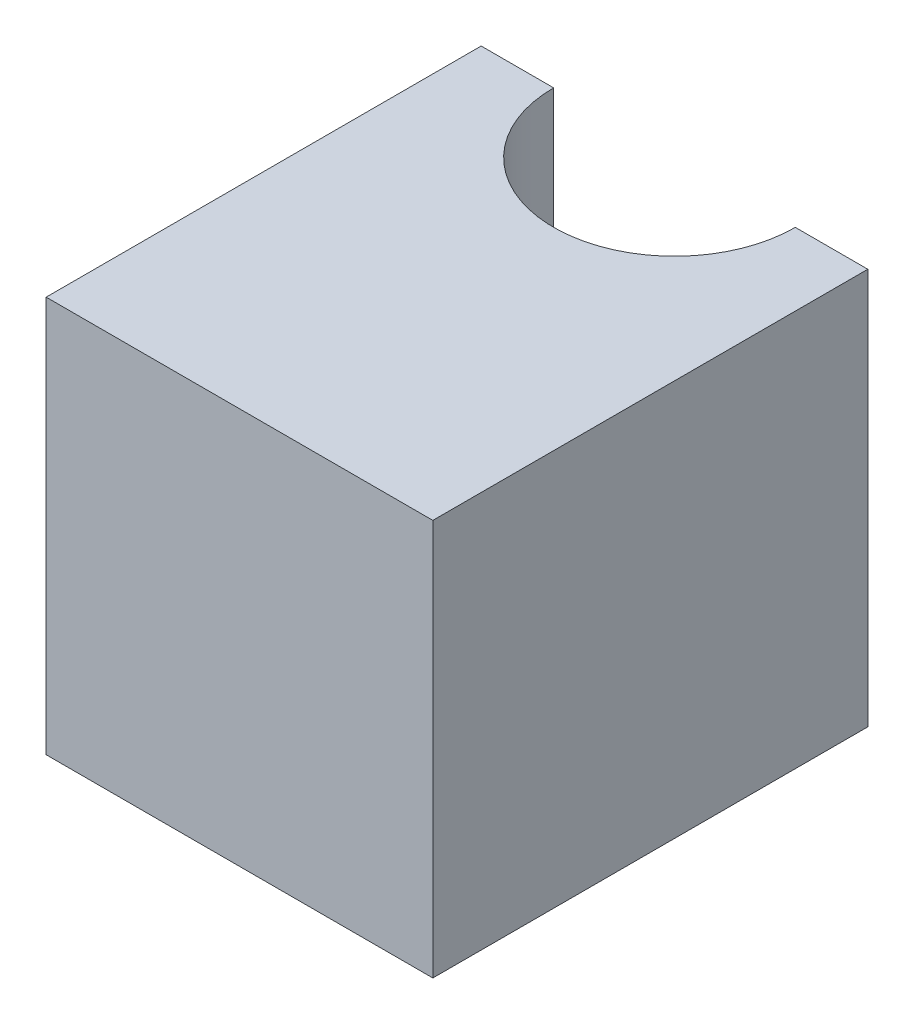
ISO-10303-21;
HEADER;
FILE_DESCRIPTION(('STEP AP214'),'2;1');
FILE_NAME('part.step','',(''),(''),'','','');
FILE_SCHEMA(('AUTOMOTIVE_DESIGN { 1 0 10303 214 1 1 1 1 }'));
ENDSEC;
DATA;
#1=APPLICATION_CONTEXT('core data for automotive mechanical design processes');
#2=APPLICATION_PROTOCOL_DEFINITION('international standard','automotive_design',2000,#1);
#3=PRODUCT_CONTEXT('',#1,'mechanical');
#4=PRODUCT('Part','Part','',(#3));
#5=PRODUCT_RELATED_PRODUCT_CATEGORY('part','',(#4));
#6=PRODUCT_DEFINITION_FORMATION('','',#4);
#7=PRODUCT_DEFINITION_CONTEXT('part definition',#1,'design');
#8=PRODUCT_DEFINITION('design','',#6,#7);
#9=PRODUCT_DEFINITION_SHAPE('','',#8);
#10=(LENGTH_UNIT() NAMED_UNIT(*) SI_UNIT(.MILLI.,.METRE.));
#11=(NAMED_UNIT(*) PLANE_ANGLE_UNIT() SI_UNIT($,.RADIAN.));
#12=(NAMED_UNIT(*) SI_UNIT($,.STERADIAN.) SOLID_ANGLE_UNIT());
#13=UNCERTAINTY_MEASURE_WITH_UNIT(LENGTH_MEASURE(1.E-05),#10,'distance_accuracy_value','');
#14=(GEOMETRIC_REPRESENTATION_CONTEXT(3) GLOBAL_UNCERTAINTY_ASSIGNED_CONTEXT((#13)) GLOBAL_UNIT_ASSIGNED_CONTEXT((#10,
#11,#12)) REPRESENTATION_CONTEXT('',''));
#15=CARTESIAN_POINT('',(0.,0.,0.));
#16=DIRECTION('',(0.,0.,1.));
#17=DIRECTION('',(1.,0.,0.));
#18=AXIS2_PLACEMENT_3D('',#15,#16,#17);
#19=CARTESIAN_POINT('',(4.1,0.,-5.2));
#20=DIRECTION('',(1.,0.,0.));
#21=DIRECTION('',(0.,0.,-1.));
#22=AXIS2_PLACEMENT_3D('',#19,#20,#21);
#23=PLANE('',#22);
#24=DIRECTION('',(0.,0.,1.));
#25=VECTOR('',#24,1.);
#26=CARTESIAN_POINT('',(4.1,0.82,-5.65));
#27=LINE('',#26,#25);
#28=CARTESIAN_POINT('',(4.1,0.82,-5.2));
#29=VERTEX_POINT('',#28);
#30=CARTESIAN_POINT('',(4.1,0.82,-6.1));
#31=VERTEX_POINT('',#30);
#32=EDGE_CURVE('E108',#29,#31,#27,.F.);
#33=ORIENTED_EDGE('',*,*,#32,.F.);
#34=DIRECTION('',(0.,1.,0.));
#35=VECTOR('',#34,1.);
#36=CARTESIAN_POINT('',(4.1,0.,-5.2));
#37=LINE('',#36,#35);
#38=CARTESIAN_POINT('',(4.1,0.,-5.2));
#39=VERTEX_POINT('',#38);
#40=EDGE_CURVE('E92',#39,#29,#37,.T.);
#41=ORIENTED_EDGE('',*,*,#40,.F.);
#42=DIRECTION('',(0.,0.,1.));
#43=VECTOR('',#42,1.);
#44=CARTESIAN_POINT('',(4.1,0.,-5.65));
#45=LINE('',#44,#43);
#46=CARTESIAN_POINT('',(4.1,0.,-6.1));
#47=VERTEX_POINT('',#46);
#48=EDGE_CURVE('E76',#39,#47,#45,.F.);
#49=ORIENTED_EDGE('',*,*,#48,.T.);
#50=DIRECTION('',(0.,1.,0.));
#51=VECTOR('',#50,1.);
#52=CARTESIAN_POINT('',(4.1,0.,-6.1));
#53=LINE('',#52,#51);
#54=EDGE_CURVE('E73',#31,#47,#53,.F.);
#55=ORIENTED_EDGE('',*,*,#54,.F.);
#56=EDGE_LOOP('',(#33,#41,#49,#55));
#57=FACE_BOUND('',#56,.T.);
#58=ADVANCED_FACE('F17',(#57),#23,.T.);
#59=CARTESIAN_POINT('',(4.1,0.,-6.1));
#60=DIRECTION('',(0.,0.,-1.));
#61=DIRECTION('',(-1.,0.,0.));
#62=AXIS2_PLACEMENT_3D('',#59,#60,#61);
#63=PLANE('',#62);
#64=DIRECTION('',(1.,0.,0.));
#65=VECTOR('',#64,1.);
#66=CARTESIAN_POINT('',(3.7,0.82,-6.1));
#67=LINE('',#66,#65);
#68=CARTESIAN_POINT('',(3.95,0.82,-6.1));
#69=VERTEX_POINT('',#68);
#70=EDGE_CURVE('E106',#31,#69,#67,.F.);
#71=ORIENTED_EDGE('',*,*,#70,.F.);
#72=ORIENTED_EDGE('',*,*,#54,.T.);
#73=DIRECTION('',(1.,0.,0.));
#74=VECTOR('',#73,1.);
#75=CARTESIAN_POINT('',(3.7,0.,-6.1));
#76=LINE('',#75,#74);
#77=CARTESIAN_POINT('',(3.95,0.,-6.1));
#78=VERTEX_POINT('',#77);
#79=EDGE_CURVE('E67',#47,#78,#76,.F.);
#80=ORIENTED_EDGE('',*,*,#79,.T.);
#81=DIRECTION('',(0.,1.,0.));
#82=VECTOR('',#81,1.);
#83=CARTESIAN_POINT('',(3.95,0.,-6.1));
#84=LINE('',#83,#82);
#85=EDGE_CURVE('E71',#78,#69,#84,.T.);
#86=ORIENTED_EDGE('',*,*,#85,.T.);
#87=EDGE_LOOP('',(#71,#72,#80,#86));
#88=FACE_BOUND('',#87,.T.);
#89=ADVANCED_FACE('F70',(#88),#63,.T.);
#90=CARTESIAN_POINT('',(3.7,0.,-6.1));
#91=DIRECTION('',(0.,1.,0.));
#92=DIRECTION('',(0.,0.,1.));
#93=AXIS2_PLACEMENT_3D('',#90,#91,#92);
#94=CYLINDRICAL_SURFACE('',#93,0.25);
#95=DIRECTION('',(0.,1.,0.));
#96=VECTOR('',#95,1.);
#97=CARTESIAN_POINT('',(3.45,0.,-6.1));
#98=LINE('',#97,#96);
#99=CARTESIAN_POINT('',(3.45,0.82,-6.1));
#100=VERTEX_POINT('',#99);
#101=CARTESIAN_POINT('',(3.45,0.,-6.1));
#102=VERTEX_POINT('',#101);
#103=EDGE_CURVE('E117',#100,#102,#98,.F.);
#104=ORIENTED_EDGE('',*,*,#103,.F.);
#105=CARTESIAN_POINT('',(3.7,0.82,-6.1));
#106=DIRECTION('',(0.,1.,0.));
#107=DIRECTION('',(0.,0.,1.));
#108=AXIS2_PLACEMENT_3D('',#105,#106,#107);
#109=CIRCLE('',#108,0.25);
#110=EDGE_CURVE('E83',#69,#100,#109,.F.);
#111=ORIENTED_EDGE('',*,*,#110,.F.);
#112=ORIENTED_EDGE('',*,*,#85,.F.);
#113=CARTESIAN_POINT('',(3.7,0.,-6.1));
#114=DIRECTION('',(0.,1.,0.));
#115=DIRECTION('',(0.,0.,1.));
#116=AXIS2_PLACEMENT_3D('',#113,#114,#115);
#117=CIRCLE('',#116,0.25);
#118=EDGE_CURVE('E20',#78,#102,#117,.F.);
#119=ORIENTED_EDGE('',*,*,#118,.T.);
#120=EDGE_LOOP('',(#104,#111,#112,#119));
#121=FACE_BOUND('',#120,.T.);
#122=ADVANCED_FACE('F81',(#121),#94,.F.);
#123=CARTESIAN_POINT('',(3.7,0.,-5.65));
#124=DIRECTION('',(0.,1.,0.));
#125=DIRECTION('',(0.,0.,1.));
#126=AXIS2_PLACEMENT_3D('',#123,#124,#125);
#127=PLANE('',#126);
#128=DIRECTION('',(0.,0.,1.));
#129=VECTOR('',#128,1.);
#130=CARTESIAN_POINT('',(3.3,0.,-6.1));
#131=LINE('',#130,#129);
#132=CARTESIAN_POINT('',(3.3,0.,-6.1));
#133=VERTEX_POINT('',#132);
#134=CARTESIAN_POINT('',(3.3,0.,-5.2));
#135=VERTEX_POINT('',#134);
#136=EDGE_CURVE('E119',#133,#135,#131,.T.);
#137=ORIENTED_EDGE('',*,*,#136,.F.);
#138=DIRECTION('',(-1.,0.,0.));
#139=VECTOR('',#138,1.);
#140=CARTESIAN_POINT('',(3.45,0.,-6.1));
#141=LINE('',#140,#139);
#142=EDGE_CURVE('E88',#102,#133,#141,.T.);
#143=ORIENTED_EDGE('',*,*,#142,.F.);
#144=ORIENTED_EDGE('',*,*,#118,.F.);
#145=ORIENTED_EDGE('',*,*,#79,.F.);
#146=ORIENTED_EDGE('',*,*,#48,.F.);
#147=DIRECTION('',(1.,0.,0.));
#148=VECTOR('',#147,1.);
#149=CARTESIAN_POINT('',(3.3,0.,-5.2));
#150=LINE('',#149,#148);
#151=EDGE_CURVE('E90',#135,#39,#150,.T.);
#152=ORIENTED_EDGE('',*,*,#151,.F.);
#153=EDGE_LOOP('',(#137,#143,#144,#145,#146,#152));
#154=FACE_BOUND('',#153,.T.);
#155=ADVANCED_FACE('F86',(#154),#127,.F.);
#156=CARTESIAN_POINT('',(3.3,0.,-5.2));
#157=DIRECTION('',(0.,0.,1.));
#158=DIRECTION('',(1.,0.,0.));
#159=AXIS2_PLACEMENT_3D('',#156,#157,#158);
#160=PLANE('',#159);
#161=DIRECTION('',(1.,0.,0.));
#162=VECTOR('',#161,1.);
#163=CARTESIAN_POINT('',(3.7,0.82,-5.2));
#164=LINE('',#163,#162);
#165=CARTESIAN_POINT('',(3.3,0.82,-5.2));
#166=VERTEX_POINT('',#165);
#167=EDGE_CURVE('E96',#166,#29,#164,.T.);
#168=ORIENTED_EDGE('',*,*,#167,.F.);
#169=DIRECTION('',(0.,1.,0.));
#170=VECTOR('',#169,1.);
#171=CARTESIAN_POINT('',(3.3,0.,-5.2));
#172=LINE('',#171,#170);
#173=EDGE_CURVE('E127',#135,#166,#172,.T.);
#174=ORIENTED_EDGE('',*,*,#173,.F.);
#175=ORIENTED_EDGE('',*,*,#151,.T.);
#176=ORIENTED_EDGE('',*,*,#40,.T.);
#177=EDGE_LOOP('',(#168,#174,#175,#176));
#178=FACE_BOUND('',#177,.T.);
#179=ADVANCED_FACE('F149',(#178),#160,.T.);
#180=CARTESIAN_POINT('',(3.7,0.82,-5.65));
#181=DIRECTION('',(0.,1.,0.));
#182=DIRECTION('',(0.,0.,1.));
#183=AXIS2_PLACEMENT_3D('',#180,#181,#182);
#184=PLANE('',#183);
#185=DIRECTION('',(-1.,0.,0.));
#186=VECTOR('',#185,1.);
#187=CARTESIAN_POINT('',(3.45,0.82,-6.1));
#188=LINE('',#187,#186);
#189=CARTESIAN_POINT('',(3.3,0.82,-6.1));
#190=VERTEX_POINT('',#189);
#191=EDGE_CURVE('E35',#190,#100,#188,.F.);
#192=ORIENTED_EDGE('',*,*,#191,.F.);
#193=DIRECTION('',(0.,0.,1.));
#194=VECTOR('',#193,1.);
#195=CARTESIAN_POINT('',(3.3,0.82,-6.1));
#196=LINE('',#195,#194);
#197=EDGE_CURVE('E26',#166,#190,#196,.F.);
#198=ORIENTED_EDGE('',*,*,#197,.F.);
#199=ORIENTED_EDGE('',*,*,#167,.T.);
#200=ORIENTED_EDGE('',*,*,#32,.T.);
#201=ORIENTED_EDGE('',*,*,#70,.T.);
#202=ORIENTED_EDGE('',*,*,#110,.T.);
#203=EDGE_LOOP('',(#192,#198,#199,#200,#201,#202));
#204=FACE_BOUND('',#203,.T.);
#205=ADVANCED_FACE('F152',(#204),#184,.T.);
#206=CARTESIAN_POINT('',(3.45,0.,-6.1));
#207=DIRECTION('',(0.,0.,-1.));
#208=DIRECTION('',(-1.,0.,0.));
#209=AXIS2_PLACEMENT_3D('',#206,#207,#208);
#210=PLANE('',#209);
#211=ORIENTED_EDGE('',*,*,#191,.T.);
#212=ORIENTED_EDGE('',*,*,#103,.T.);
#213=ORIENTED_EDGE('',*,*,#142,.T.);
#214=DIRECTION('',(0.,1.,0.));
#215=VECTOR('',#214,1.);
#216=CARTESIAN_POINT('',(3.3,0.,-6.1));
#217=LINE('',#216,#215);
#218=EDGE_CURVE('E11',#190,#133,#217,.F.);
#219=ORIENTED_EDGE('',*,*,#218,.F.);
#220=EDGE_LOOP('',(#211,#212,#213,#219));
#221=FACE_BOUND('',#220,.T.);
#222=ADVANCED_FACE('F154',(#221),#210,.T.);
#223=CARTESIAN_POINT('',(3.3,0.,-6.1));
#224=DIRECTION('',(-1.,0.,0.));
#225=DIRECTION('',(0.,0.,1.));
#226=AXIS2_PLACEMENT_3D('',#223,#224,#225);
#227=PLANE('',#226);
#228=ORIENTED_EDGE('',*,*,#197,.T.);
#229=ORIENTED_EDGE('',*,*,#218,.T.);
#230=ORIENTED_EDGE('',*,*,#136,.T.);
#231=ORIENTED_EDGE('',*,*,#173,.T.);
#232=EDGE_LOOP('',(#228,#229,#230,#231));
#233=FACE_BOUND('',#232,.T.);
#234=ADVANCED_FACE('F148',(#233),#227,.T.);
#235=CLOSED_SHELL('',(#58,#89,#122,#155,#179,#205,#222,#234));
#236=MANIFOLD_SOLID_BREP('B1',#235);
#237=ADVANCED_BREP_SHAPE_REPRESENTATION('',(#18,#236),#14);
#238=SHAPE_DEFINITION_REPRESENTATION(#9,#237);
ENDSEC;
END-ISO-10303-21;
